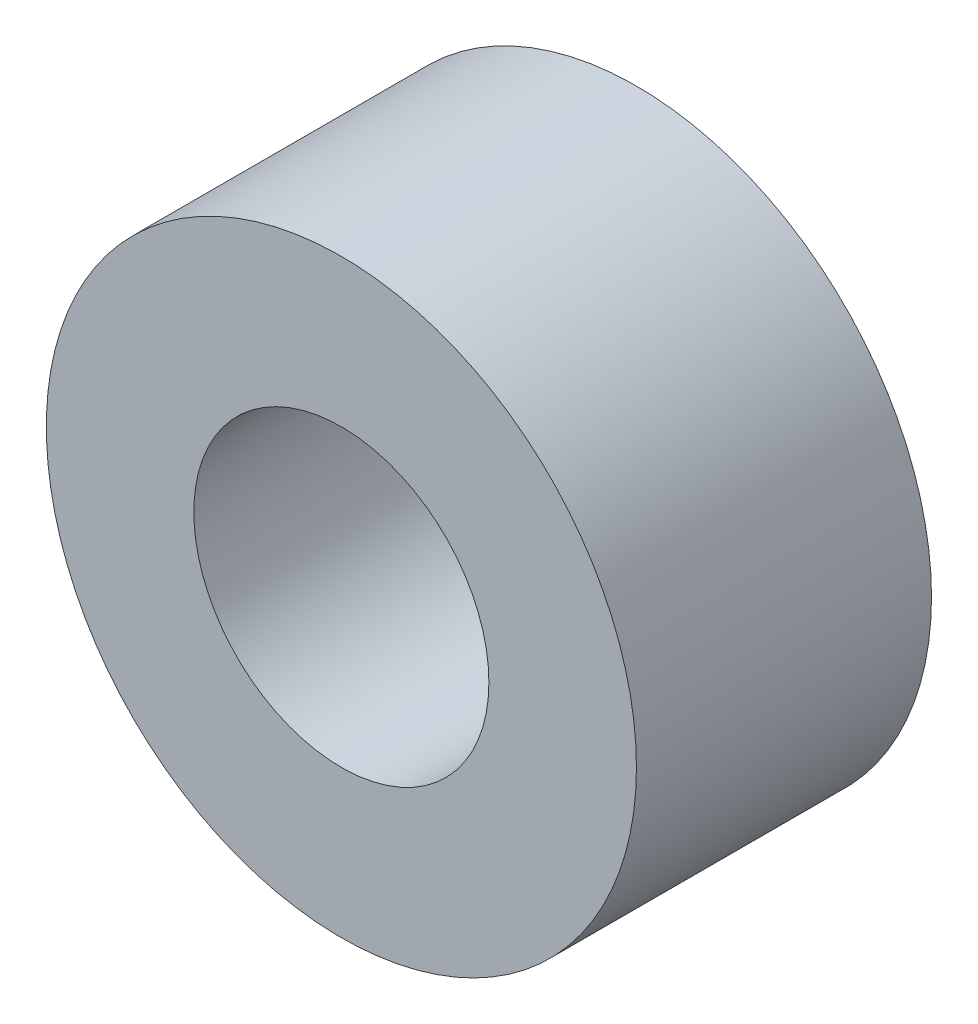
ISO-10303-21;
HEADER;
FILE_DESCRIPTION(('STEP AP214'),'2;1');
FILE_NAME('part.step','',(''),(''),'','','');
FILE_SCHEMA(('AUTOMOTIVE_DESIGN { 1 0 10303 214 1 1 1 1 }'));
ENDSEC;
DATA;
#1=APPLICATION_CONTEXT('core data for automotive mechanical design processes');
#2=APPLICATION_PROTOCOL_DEFINITION('international standard','automotive_design',2000,#1);
#3=PRODUCT_CONTEXT('',#1,'mechanical');
#4=PRODUCT('Part','Part','',(#3));
#5=PRODUCT_RELATED_PRODUCT_CATEGORY('part','',(#4));
#6=PRODUCT_DEFINITION_FORMATION('','',#4);
#7=PRODUCT_DEFINITION_CONTEXT('part definition',#1,'design');
#8=PRODUCT_DEFINITION('design','',#6,#7);
#9=PRODUCT_DEFINITION_SHAPE('','',#8);
#10=(LENGTH_UNIT() NAMED_UNIT(*) SI_UNIT(.MILLI.,.METRE.));
#11=(NAMED_UNIT(*) PLANE_ANGLE_UNIT() SI_UNIT($,.RADIAN.));
#12=(NAMED_UNIT(*) SI_UNIT($,.STERADIAN.) SOLID_ANGLE_UNIT());
#13=UNCERTAINTY_MEASURE_WITH_UNIT(LENGTH_MEASURE(1.E-05),#10,'distance_accuracy_value','');
#14=(GEOMETRIC_REPRESENTATION_CONTEXT(3) GLOBAL_UNCERTAINTY_ASSIGNED_CONTEXT((#13)) GLOBAL_UNIT_ASSIGNED_CONTEXT((#10,
#11,#12)) REPRESENTATION_CONTEXT('',''));
#15=CARTESIAN_POINT('',(0.,0.,0.));
#16=DIRECTION('',(0.,0.,1.));
#17=DIRECTION('',(1.,0.,0.));
#18=AXIS2_PLACEMENT_3D('',#15,#16,#17);
#19=CARTESIAN_POINT('',(0.,0.,6.35));
#20=DIRECTION('',(0.,0.,1.));
#21=DIRECTION('',(1.,0.,0.));
#22=AXIS2_PLACEMENT_3D('',#19,#20,#21);
#23=PLANE('',#22);
#24=CARTESIAN_POINT('',(0.,0.,6.35));
#25=DIRECTION('',(0.,0.,1.));
#26=DIRECTION('',(1.,0.,0.));
#27=AXIS2_PLACEMENT_3D('',#24,#25,#26);
#28=CIRCLE('',#27,6.35);
#29=CARTESIAN_POINT('',(6.35,0.,6.35));
#30=VERTEX_POINT('',#29);
#31=EDGE_CURVE('E10',#30,#30,#28,.T.);
#32=ORIENTED_EDGE('',*,*,#31,.T.);
#33=EDGE_LOOP('',(#32));
#34=FACE_BOUND('',#33,.T.);
#35=CARTESIAN_POINT('',(0.,0.,6.35));
#36=DIRECTION('',(0.,0.,1.));
#37=DIRECTION('',(1.,0.,0.));
#38=AXIS2_PLACEMENT_3D('',#35,#36,#37);
#39=CIRCLE('',#38,3.175);
#40=CARTESIAN_POINT('',(3.175,0.,6.35));
#41=VERTEX_POINT('',#40);
#42=EDGE_CURVE('E41',#41,#41,#39,.T.);
#43=ORIENTED_EDGE('',*,*,#42,.F.);
#44=EDGE_LOOP('',(#43));
#45=FACE_BOUND('',#44,.T.);
#46=ADVANCED_FACE('F30',(#34,#45),#23,.T.);
#47=CARTESIAN_POINT('',(0.,0.,0.));
#48=DIRECTION('',(0.,0.,1.));
#49=DIRECTION('',(1.,0.,0.));
#50=AXIS2_PLACEMENT_3D('',#47,#48,#49);
#51=PLANE('',#50);
#52=CARTESIAN_POINT('',(0.,0.,0.));
#53=DIRECTION('',(0.,0.,1.));
#54=DIRECTION('',(1.,0.,0.));
#55=AXIS2_PLACEMENT_3D('',#52,#53,#54);
#56=CIRCLE('',#55,6.35);
#57=CARTESIAN_POINT('',(6.35,0.,0.));
#58=VERTEX_POINT('',#57);
#59=EDGE_CURVE('E34',#58,#58,#56,.T.);
#60=ORIENTED_EDGE('',*,*,#59,.F.);
#61=EDGE_LOOP('',(#60));
#62=FACE_BOUND('',#61,.T.);
#63=CARTESIAN_POINT('',(0.,0.,0.));
#64=DIRECTION('',(0.,0.,1.));
#65=DIRECTION('',(1.,0.,0.));
#66=AXIS2_PLACEMENT_3D('',#63,#64,#65);
#67=CIRCLE('',#66,3.175);
#68=CARTESIAN_POINT('',(3.175,0.,0.));
#69=VERTEX_POINT('',#68);
#70=EDGE_CURVE('E43',#69,#69,#67,.T.);
#71=ORIENTED_EDGE('',*,*,#70,.T.);
#72=EDGE_LOOP('',(#71));
#73=FACE_BOUND('',#72,.T.);
#74=ADVANCED_FACE('F53',(#62,#73),#51,.F.);
#75=CARTESIAN_POINT('',(0.,0.,6.35));
#76=DIRECTION('',(0.,0.,-1.));
#77=DIRECTION('',(-1.,0.,0.));
#78=AXIS2_PLACEMENT_3D('',#75,#76,#77);
#79=CYLINDRICAL_SURFACE('',#78,6.35);
#80=ORIENTED_EDGE('',*,*,#31,.F.);
#81=EDGE_LOOP('',(#80));
#82=FACE_BOUND('',#81,.T.);
#83=ORIENTED_EDGE('',*,*,#59,.T.);
#84=EDGE_LOOP('',(#83));
#85=FACE_BOUND('',#84,.T.);
#86=ADVANCED_FACE('F32',(#82,#85),#79,.T.);
#87=CARTESIAN_POINT('',(0.,0.,6.35));
#88=DIRECTION('',(0.,0.,-1.));
#89=DIRECTION('',(-1.,0.,0.));
#90=AXIS2_PLACEMENT_3D('',#87,#88,#89);
#91=CYLINDRICAL_SURFACE('',#90,3.175);
#92=ORIENTED_EDGE('',*,*,#42,.T.);
#93=EDGE_LOOP('',(#92));
#94=FACE_BOUND('',#93,.T.);
#95=ORIENTED_EDGE('',*,*,#70,.F.);
#96=EDGE_LOOP('',(#95));
#97=FACE_BOUND('',#96,.T.);
#98=ADVANCED_FACE('F49',(#94,#97),#91,.F.);
#99=CLOSED_SHELL('',(#46,#74,#86,#98));
#100=MANIFOLD_SOLID_BREP('B2',#99);
#101=ADVANCED_BREP_SHAPE_REPRESENTATION('',(#18,#100),#14);
#102=SHAPE_DEFINITION_REPRESENTATION(#9,#101);
ENDSEC;
END-ISO-10303-21;
